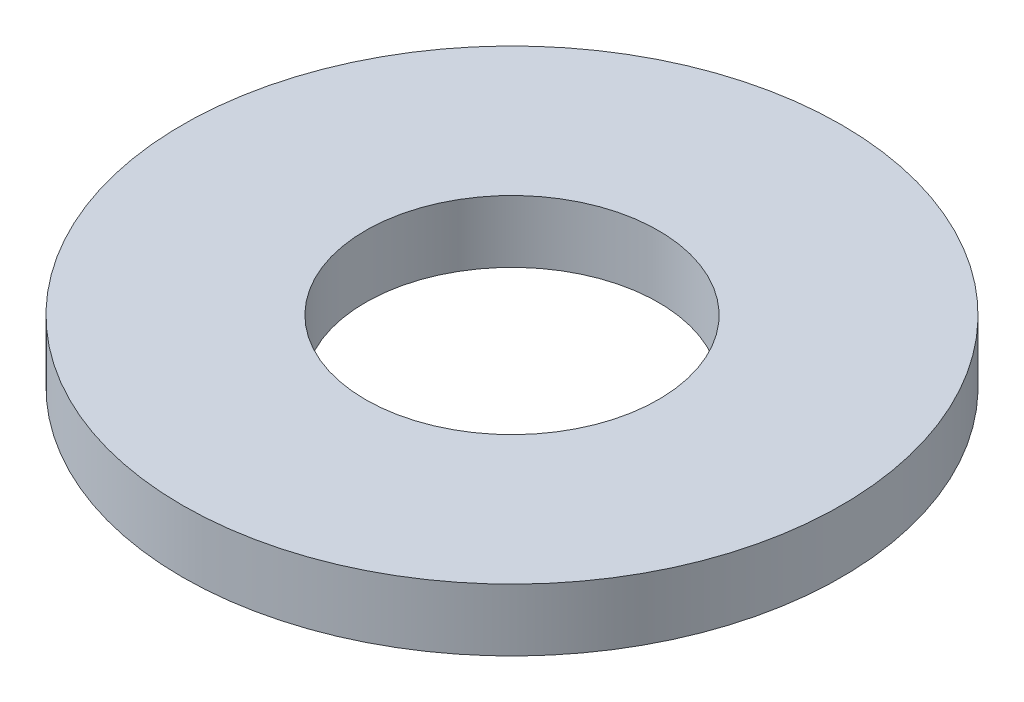
ISO-10303-21;
HEADER;
FILE_DESCRIPTION(('STEP AP214'),'2;1');
FILE_NAME('part.step','',(''),(''),'','','');
FILE_SCHEMA(('AUTOMOTIVE_DESIGN { 1 0 10303 214 1 1 1 1 }'));
ENDSEC;
DATA;
#1=APPLICATION_CONTEXT('core data for automotive mechanical design processes');
#2=APPLICATION_PROTOCOL_DEFINITION('international standard','automotive_design',2000,#1);
#3=PRODUCT_CONTEXT('',#1,'mechanical');
#4=PRODUCT('Part','Part','',(#3));
#5=PRODUCT_RELATED_PRODUCT_CATEGORY('part','',(#4));
#6=PRODUCT_DEFINITION_FORMATION('','',#4);
#7=PRODUCT_DEFINITION_CONTEXT('part definition',#1,'design');
#8=PRODUCT_DEFINITION('design','',#6,#7);
#9=PRODUCT_DEFINITION_SHAPE('','',#8);
#10=(LENGTH_UNIT() NAMED_UNIT(*) SI_UNIT(.MILLI.,.METRE.));
#11=(NAMED_UNIT(*) PLANE_ANGLE_UNIT() SI_UNIT($,.RADIAN.));
#12=(NAMED_UNIT(*) SI_UNIT($,.STERADIAN.) SOLID_ANGLE_UNIT());
#13=UNCERTAINTY_MEASURE_WITH_UNIT(LENGTH_MEASURE(1.E-05),#10,'distance_accuracy_value','');
#14=(GEOMETRIC_REPRESENTATION_CONTEXT(3) GLOBAL_UNCERTAINTY_ASSIGNED_CONTEXT((#13)) GLOBAL_UNIT_ASSIGNED_CONTEXT((#10,
#11,#12)) REPRESENTATION_CONTEXT('',''));
#15=CARTESIAN_POINT('',(0.,0.,0.));
#16=DIRECTION('',(0.,0.,1.));
#17=DIRECTION('',(1.,0.,0.));
#18=AXIS2_PLACEMENT_3D('',#15,#16,#17);
#19=CARTESIAN_POINT('',(0.,17.,0.));
#20=DIRECTION('',(0.,-1.,0.));
#21=DIRECTION('',(0.,0.,-1.));
#22=AXIS2_PLACEMENT_3D('',#19,#20,#21);
#23=CYLINDRICAL_SURFACE('',#22,90.);
#24=CARTESIAN_POINT('',(0.,17.,0.));
#25=DIRECTION('',(0.,1.,0.));
#26=DIRECTION('',(0.,0.,1.));
#27=AXIS2_PLACEMENT_3D('',#24,#25,#26);
#28=CIRCLE('',#27,90.);
#29=CARTESIAN_POINT('',(0.,17.,90.));
#30=VERTEX_POINT('',#29);
#31=EDGE_CURVE('E10',#30,#30,#28,.T.);
#32=ORIENTED_EDGE('',*,*,#31,.F.);
#33=EDGE_LOOP('',(#32));
#34=FACE_BOUND('',#33,.T.);
#35=CARTESIAN_POINT('',(0.,0.,0.));
#36=DIRECTION('',(0.,1.,0.));
#37=DIRECTION('',(0.,0.,1.));
#38=AXIS2_PLACEMENT_3D('',#35,#36,#37);
#39=CIRCLE('',#38,90.);
#40=CARTESIAN_POINT('',(0.,0.,90.));
#41=VERTEX_POINT('',#40);
#42=EDGE_CURVE('E37',#41,#41,#39,.T.);
#43=ORIENTED_EDGE('',*,*,#42,.T.);
#44=EDGE_LOOP('',(#43));
#45=FACE_BOUND('',#44,.T.);
#46=ADVANCED_FACE('F40',(#34,#45),#23,.T.);
#47=CARTESIAN_POINT('',(0.,17.,0.));
#48=DIRECTION('',(0.,1.,0.));
#49=DIRECTION('',(0.,0.,1.));
#50=AXIS2_PLACEMENT_3D('',#47,#48,#49);
#51=PLANE('',#50);
#52=CARTESIAN_POINT('',(0.,17.,0.));
#53=DIRECTION('',(0.,1.,0.));
#54=DIRECTION('',(0.,0.,1.));
#55=AXIS2_PLACEMENT_3D('',#52,#53,#54);
#56=CIRCLE('',#55,40.);
#57=CARTESIAN_POINT('',(0.,17.,40.));
#58=VERTEX_POINT('',#57);
#59=EDGE_CURVE('E50',#58,#58,#56,.T.);
#60=ORIENTED_EDGE('',*,*,#59,.F.);
#61=EDGE_LOOP('',(#60));
#62=FACE_BOUND('',#61,.T.);
#63=ORIENTED_EDGE('',*,*,#31,.T.);
#64=EDGE_LOOP('',(#63));
#65=FACE_BOUND('',#64,.T.);
#66=ADVANCED_FACE('F59',(#62,#65),#51,.T.);
#67=CARTESIAN_POINT('',(0.,0.,0.));
#68=DIRECTION('',(0.,1.,0.));
#69=DIRECTION('',(0.,0.,1.));
#70=AXIS2_PLACEMENT_3D('',#67,#68,#69);
#71=PLANE('',#70);
#72=CARTESIAN_POINT('',(0.,0.,0.));
#73=DIRECTION('',(0.,1.,0.));
#74=DIRECTION('',(0.,0.,1.));
#75=AXIS2_PLACEMENT_3D('',#72,#73,#74);
#76=CIRCLE('',#75,40.);
#77=CARTESIAN_POINT('',(0.,0.,40.));
#78=VERTEX_POINT('',#77);
#79=EDGE_CURVE('E47',#78,#78,#76,.T.);
#80=ORIENTED_EDGE('',*,*,#79,.T.);
#81=EDGE_LOOP('',(#80));
#82=FACE_BOUND('',#81,.T.);
#83=ORIENTED_EDGE('',*,*,#42,.F.);
#84=EDGE_LOOP('',(#83));
#85=FACE_BOUND('',#84,.T.);
#86=ADVANCED_FACE('F58',(#82,#85),#71,.F.);
#87=CARTESIAN_POINT('',(0.,17.,0.));
#88=DIRECTION('',(0.,-1.,0.));
#89=DIRECTION('',(0.,0.,-1.));
#90=AXIS2_PLACEMENT_3D('',#87,#88,#89);
#91=CYLINDRICAL_SURFACE('',#90,40.);
#92=ORIENTED_EDGE('',*,*,#59,.T.);
#93=EDGE_LOOP('',(#92));
#94=FACE_BOUND('',#93,.T.);
#95=ORIENTED_EDGE('',*,*,#79,.F.);
#96=EDGE_LOOP('',(#95));
#97=FACE_BOUND('',#96,.T.);
#98=ADVANCED_FACE('F54',(#94,#97),#91,.F.);
#99=CLOSED_SHELL('',(#46,#66,#86,#98));
#100=MANIFOLD_SOLID_BREP('B2',#99);
#101=ADVANCED_BREP_SHAPE_REPRESENTATION('',(#18,#100),#14);
#102=SHAPE_DEFINITION_REPRESENTATION(#9,#101);
ENDSEC;
END-ISO-10303-21;
